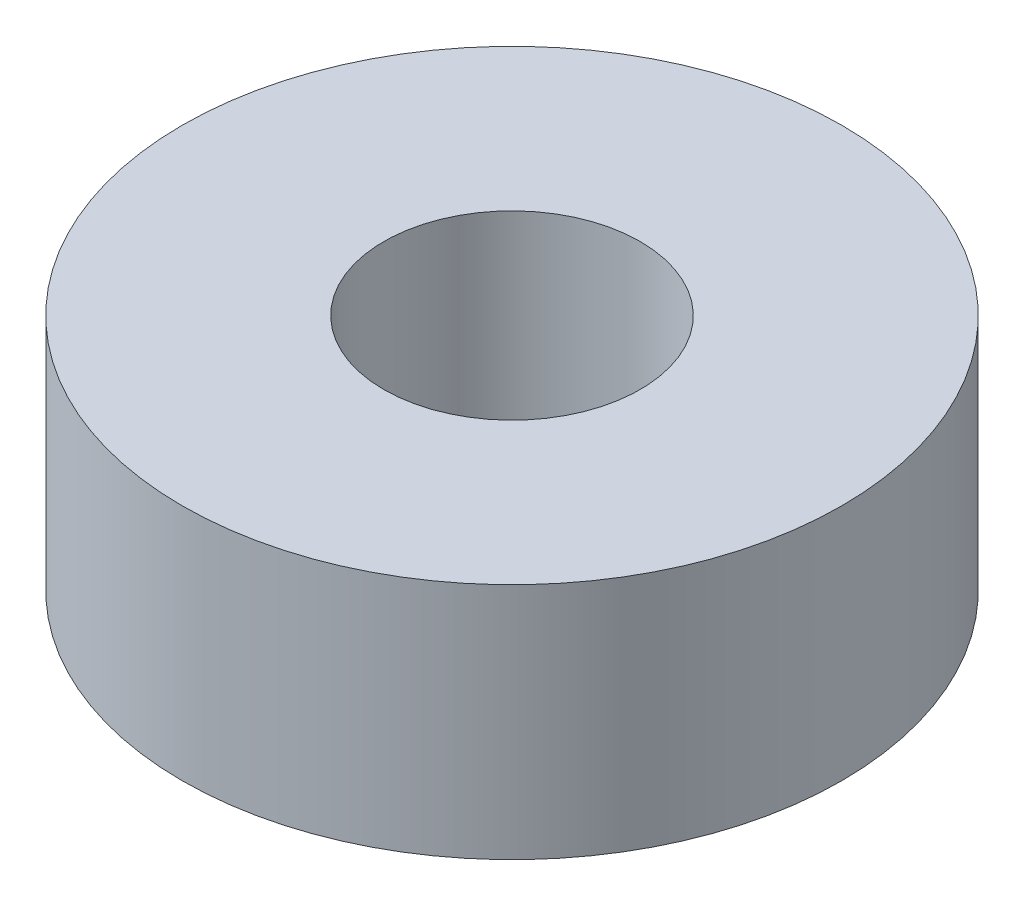
ISO-10303-21;
HEADER;
FILE_DESCRIPTION(('STEP AP214'),'2;1');
FILE_NAME('part.step','',(''),(''),'','','');
FILE_SCHEMA(('AUTOMOTIVE_DESIGN { 1 0 10303 214 1 1 1 1 }'));
ENDSEC;
DATA;
#1=APPLICATION_CONTEXT('core data for automotive mechanical design processes');
#2=APPLICATION_PROTOCOL_DEFINITION('international standard','automotive_design',2000,#1);
#3=PRODUCT_CONTEXT('',#1,'mechanical');
#4=PRODUCT('Part','Part','',(#3));
#5=PRODUCT_RELATED_PRODUCT_CATEGORY('part','',(#4));
#6=PRODUCT_DEFINITION_FORMATION('','',#4);
#7=PRODUCT_DEFINITION_CONTEXT('part definition',#1,'design');
#8=PRODUCT_DEFINITION('design','',#6,#7);
#9=PRODUCT_DEFINITION_SHAPE('','',#8);
#10=(LENGTH_UNIT() NAMED_UNIT(*) SI_UNIT(.MILLI.,.METRE.));
#11=(NAMED_UNIT(*) PLANE_ANGLE_UNIT() SI_UNIT($,.RADIAN.));
#12=(NAMED_UNIT(*) SI_UNIT($,.STERADIAN.) SOLID_ANGLE_UNIT());
#13=UNCERTAINTY_MEASURE_WITH_UNIT(LENGTH_MEASURE(1.E-05),#10,'distance_accuracy_value','');
#14=(GEOMETRIC_REPRESENTATION_CONTEXT(3) GLOBAL_UNCERTAINTY_ASSIGNED_CONTEXT((#13)) GLOBAL_UNIT_ASSIGNED_CONTEXT((#10,
#11,#12)) REPRESENTATION_CONTEXT('',''));
#15=CARTESIAN_POINT('',(0.,0.,0.));
#16=DIRECTION('',(0.,0.,1.));
#17=DIRECTION('',(1.,0.,0.));
#18=AXIS2_PLACEMENT_3D('',#15,#16,#17);
#19=CARTESIAN_POINT('',(0.,3.25,0.));
#20=DIRECTION('',(0.,1.,0.));
#21=DIRECTION('',(0.,0.,1.));
#22=AXIS2_PLACEMENT_3D('',#19,#20,#21);
#23=PLANE('',#22);
#24=CARTESIAN_POINT('',(0.,3.25,0.));
#25=DIRECTION('',(0.,1.,0.));
#26=DIRECTION('',(0.,0.,1.));
#27=AXIS2_PLACEMENT_3D('',#24,#25,#26);
#28=CIRCLE('',#27,9.);
#29=CARTESIAN_POINT('',(0.,3.25,9.));
#30=VERTEX_POINT('',#29);
#31=EDGE_CURVE('E12',#30,#30,#28,.T.);
#32=ORIENTED_EDGE('',*,*,#31,.T.);
#33=EDGE_LOOP('',(#32));
#34=FACE_BOUND('',#33,.T.);
#35=CARTESIAN_POINT('',(0.,3.25,0.));
#36=DIRECTION('',(0.,1.,0.));
#37=DIRECTION('',(0.,0.,1.));
#38=AXIS2_PLACEMENT_3D('',#35,#36,#37);
#39=CIRCLE('',#38,3.5);
#40=CARTESIAN_POINT('',(0.,3.25,3.5));
#41=VERTEX_POINT('',#40);
#42=EDGE_CURVE('E56',#41,#41,#39,.T.);
#43=ORIENTED_EDGE('',*,*,#42,.F.);
#44=EDGE_LOOP('',(#43));
#45=FACE_BOUND('',#44,.T.);
#46=ADVANCED_FACE('F45',(#34,#45),#23,.T.);
#47=CARTESIAN_POINT('',(0.,-3.25,0.));
#48=DIRECTION('',(0.,1.,0.));
#49=DIRECTION('',(0.,0.,1.));
#50=AXIS2_PLACEMENT_3D('',#47,#48,#49);
#51=PLANE('',#50);
#52=CARTESIAN_POINT('',(0.,-3.25,0.));
#53=DIRECTION('',(0.,1.,0.));
#54=DIRECTION('',(0.,0.,1.));
#55=AXIS2_PLACEMENT_3D('',#52,#53,#54);
#56=CIRCLE('',#55,9.);
#57=CARTESIAN_POINT('',(0.,-3.25,9.));
#58=VERTEX_POINT('',#57);
#59=EDGE_CURVE('E49',#58,#58,#56,.T.);
#60=ORIENTED_EDGE('',*,*,#59,.F.);
#61=EDGE_LOOP('',(#60));
#62=FACE_BOUND('',#61,.T.);
#63=CARTESIAN_POINT('',(0.,-3.25,0.));
#64=DIRECTION('',(0.,1.,0.));
#65=DIRECTION('',(0.,0.,1.));
#66=AXIS2_PLACEMENT_3D('',#63,#64,#65);
#67=CIRCLE('',#66,3.5);
#68=CARTESIAN_POINT('',(0.,-3.25,3.5));
#69=VERTEX_POINT('',#68);
#70=EDGE_CURVE('E58',#69,#69,#67,.T.);
#71=ORIENTED_EDGE('',*,*,#70,.T.);
#72=EDGE_LOOP('',(#71));
#73=FACE_BOUND('',#72,.T.);
#74=ADVANCED_FACE('F68',(#62,#73),#51,.F.);
#75=CARTESIAN_POINT('',(0.,3.25,0.));
#76=DIRECTION('',(0.,-1.,0.));
#77=DIRECTION('',(0.,0.,-1.));
#78=AXIS2_PLACEMENT_3D('',#75,#76,#77);
#79=CYLINDRICAL_SURFACE('',#78,9.);
#80=ORIENTED_EDGE('',*,*,#31,.F.);
#81=EDGE_LOOP('',(#80));
#82=FACE_BOUND('',#81,.T.);
#83=ORIENTED_EDGE('',*,*,#59,.T.);
#84=EDGE_LOOP('',(#83));
#85=FACE_BOUND('',#84,.T.);
#86=ADVANCED_FACE('F47',(#82,#85),#79,.T.);
#87=CARTESIAN_POINT('',(0.,3.25,0.));
#88=DIRECTION('',(0.,-1.,0.));
#89=DIRECTION('',(0.,0.,-1.));
#90=AXIS2_PLACEMENT_3D('',#87,#88,#89);
#91=CYLINDRICAL_SURFACE('',#90,3.5);
#92=ORIENTED_EDGE('',*,*,#42,.T.);
#93=EDGE_LOOP('',(#92));
#94=FACE_BOUND('',#93,.T.);
#95=ORIENTED_EDGE('',*,*,#70,.F.);
#96=EDGE_LOOP('',(#95));
#97=FACE_BOUND('',#96,.T.);
#98=ADVANCED_FACE('F64',(#94,#97),#91,.F.);
#99=CLOSED_SHELL('',(#46,#74,#86,#98));
#100=MANIFOLD_SOLID_BREP('B2',#99);
#101=ADVANCED_BREP_SHAPE_REPRESENTATION('',(#18,#100),#14);
#102=SHAPE_DEFINITION_REPRESENTATION(#9,#101);
ENDSEC;
END-ISO-10303-21;
